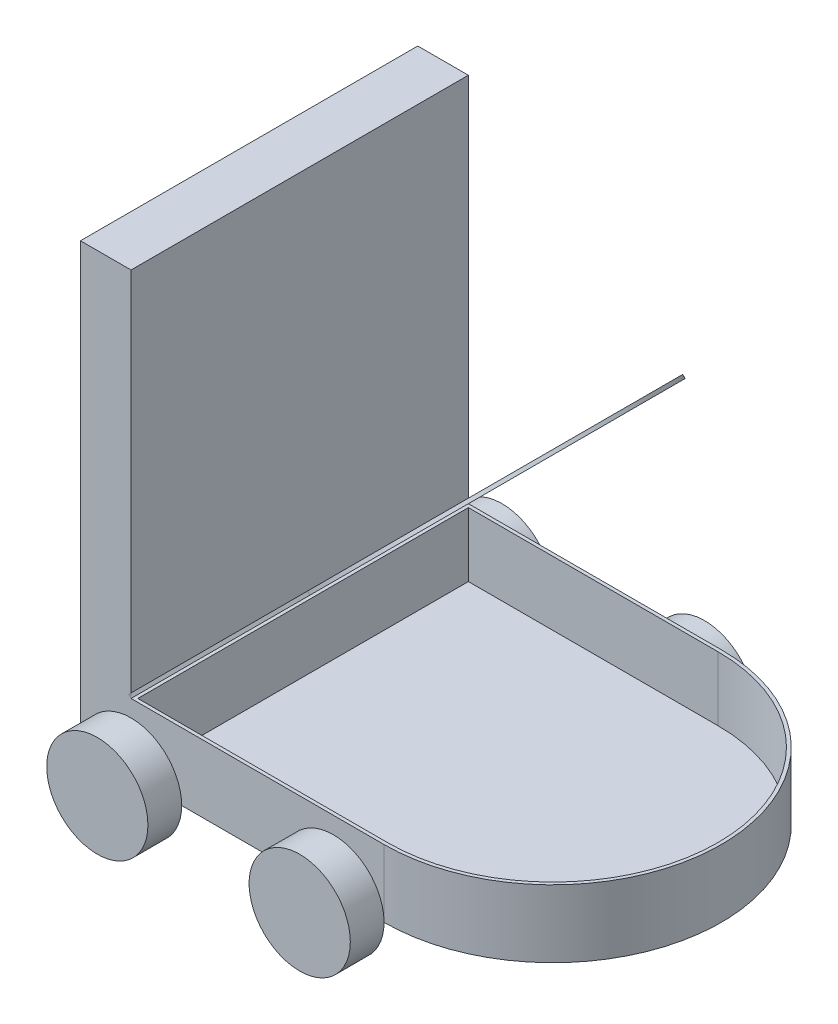
ISO-10303-21;
HEADER;
FILE_DESCRIPTION(('STEP AP214'),'2;1');
FILE_NAME('part.step','',(''),(''),'','','');
FILE_SCHEMA(('AUTOMOTIVE_DESIGN { 1 0 10303 214 1 1 1 1 }'));
ENDSEC;
DATA;
#1=APPLICATION_CONTEXT('core data for automotive mechanical design processes');
#2=APPLICATION_PROTOCOL_DEFINITION('international standard','automotive_design',2000,#1);
#3=PRODUCT_CONTEXT('',#1,'mechanical');
#4=PRODUCT('Part','Part','',(#3));
#5=PRODUCT_RELATED_PRODUCT_CATEGORY('part','',(#4));
#6=PRODUCT_DEFINITION_FORMATION('','',#4);
#7=PRODUCT_DEFINITION_CONTEXT('part definition',#1,'design');
#8=PRODUCT_DEFINITION('design','',#6,#7);
#9=PRODUCT_DEFINITION_SHAPE('','',#8);
#10=(LENGTH_UNIT() NAMED_UNIT(*) SI_UNIT(.MILLI.,.METRE.));
#11=(NAMED_UNIT(*) PLANE_ANGLE_UNIT() SI_UNIT($,.RADIAN.));
#12=(NAMED_UNIT(*) SI_UNIT($,.STERADIAN.) SOLID_ANGLE_UNIT());
#13=UNCERTAINTY_MEASURE_WITH_UNIT(LENGTH_MEASURE(1.E-05),#10,'distance_accuracy_value','');
#14=(GEOMETRIC_REPRESENTATION_CONTEXT(3) GLOBAL_UNCERTAINTY_ASSIGNED_CONTEXT((#13)) GLOBAL_UNIT_ASSIGNED_CONTEXT((#10,
#11,#12)) REPRESENTATION_CONTEXT('',''));
#15=CARTESIAN_POINT('',(0.,0.,0.));
#16=DIRECTION('',(0.,0.,1.));
#17=DIRECTION('',(1.,0.,0.));
#18=AXIS2_PLACEMENT_3D('',#15,#16,#17);
#19=CARTESIAN_POINT('',(67.3259018078044,88.7401153701777,-50.));
#20=DIRECTION('',(0.707106781186549,-0.707106781186546,0.));
#21=DIRECTION('',(0.707106781186546,0.707106781186549,0.));
#22=AXIS2_PLACEMENT_3D('',#19,#20,#21);
#23=PLANE('',#22);
#24=DIRECTION('',(-0.353553390593273,-0.353553390593274,-0.866025403784439));
#25=VECTOR('',#24,1.);
#26=CARTESIAN_POINT('',(49.6482322781408,71.062445840514,-9.99999999999999));
#27=LINE('',#26,#25);
#28=CARTESIAN_POINT('',(49.6482322781408,71.062445840514,-9.99999999999999));
#29=VERTEX_POINT('',#28);
#30=CARTESIAN_POINT('',(35.5060966544098,56.920310216783,-44.6410161513775));
#31=VERTEX_POINT('',#30);
#32=EDGE_CURVE('E201',#29,#31,#27,.T.);
#33=ORIENTED_EDGE('',*,*,#32,.F.);
#34=DIRECTION('',(0.707106781186546,0.707106781186549,0.));
#35=VECTOR('',#34,1.);
#36=CARTESIAN_POINT('',(21.3639610306789,42.778174593052,-9.99999999999999));
#37=LINE('',#36,#35);
#38=CARTESIAN_POINT('',(21.3639610306789,42.778174593052,-9.99999999999999));
#39=VERTEX_POINT('',#38);
#40=EDGE_CURVE('E207',#39,#29,#37,.T.);
#41=ORIENTED_EDGE('',*,*,#40,.F.);
#42=DIRECTION('',(-0.353553390593273,-0.353553390593274,0.866025403784439));
#43=VECTOR('',#42,1.);
#44=CARTESIAN_POINT('',(35.5060966544098,56.920310216783,-44.6410161513775));
#45=LINE('',#44,#43);
#46=EDGE_CURVE('E203',#31,#39,#45,.T.);
#47=ORIENTED_EDGE('',*,*,#46,.F.);
#48=EDGE_LOOP('',(#33,#41,#47));
#49=FACE_BOUND('',#48,.T.);
#50=CARTESIAN_POINT('',(67.3259018078044,88.7401153701777,-50.));
#51=DIRECTION('',(-0.707106781186549,0.707106781186546,0.));
#52=DIRECTION('',(0.707106781186546,0.707106781186549,0.));
#53=AXIS2_PLACEMENT_3D('',#50,#51,#52);
#54=CIRCLE('',#53,50.);
#55=CARTESIAN_POINT('',(67.3259018078044,88.7401153701777,0.));
#56=VERTEX_POINT('',#55);
#57=CARTESIAN_POINT('',(67.3259018078044,88.7401153701777,-100.));
#58=VERTEX_POINT('',#57);
#59=EDGE_CURVE('E256',#56,#58,#54,.T.);
#60=ORIENTED_EDGE('',*,*,#59,.T.);
#61=DIRECTION('',(-0.707106781186546,-0.707106781186549,0.));
#62=VECTOR('',#61,1.);
#63=CARTESIAN_POINT('',(67.3259018078044,88.7401153701777,-100.));
#64=LINE('',#63,#62);
#65=CARTESIAN_POINT('',(14.2928932188134,35.7071067811866,-100.));
#66=VERTEX_POINT('',#65);
#67=EDGE_CURVE('E259',#58,#66,#64,.T.);
#68=ORIENTED_EDGE('',*,*,#67,.T.);
#69=DIRECTION('',(0.,0.,1.));
#70=VECTOR('',#69,1.);
#71=CARTESIAN_POINT('',(14.2928932188134,35.7071067811866,-100.));
#72=LINE('',#71,#70);
#73=CARTESIAN_POINT('',(14.2928932188134,35.7071067811866,0.));
#74=VERTEX_POINT('',#73);
#75=EDGE_CURVE('E262',#66,#74,#72,.T.);
#76=ORIENTED_EDGE('',*,*,#75,.T.);
#77=DIRECTION('',(0.707106781186546,0.707106781186549,0.));
#78=VECTOR('',#77,1.);
#79=CARTESIAN_POINT('',(67.3259018078044,88.7401153701777,0.));
#80=LINE('',#79,#78);
#81=EDGE_CURVE('E264',#74,#56,#80,.T.);
#82=ORIENTED_EDGE('',*,*,#81,.T.);
#83=EDGE_LOOP('',(#60,#68,#76,#82));
#84=FACE_BOUND('',#83,.T.);
#85=DIRECTION('',(0.,0.,1.));
#86=VECTOR('',#85,1.);
#87=CARTESIAN_POINT('',(21.3639610306789,42.778174593052,-90.));
#88=LINE('',#87,#86);
#89=CARTESIAN_POINT('',(21.3639610306789,42.778174593052,-90.));
#90=VERTEX_POINT('',#89);
#91=CARTESIAN_POINT('',(21.3639610306789,42.778174593052,-50.));
#92=VERTEX_POINT('',#91);
#93=EDGE_CURVE('E225',#90,#92,#88,.T.);
#94=ORIENTED_EDGE('',*,*,#93,.F.);
#95=DIRECTION('',(-0.707106781186546,-0.707106781186549,0.));
#96=VECTOR('',#95,1.);
#97=CARTESIAN_POINT('',(21.3639610306789,42.778174593052,-90.));
#98=LINE('',#97,#96);
#99=CARTESIAN_POINT('',(49.6482322781408,71.062445840514,-90.));
#100=VERTEX_POINT('',#99);
#101=EDGE_CURVE('E233',#100,#90,#98,.T.);
#102=ORIENTED_EDGE('',*,*,#101,.F.);
#103=DIRECTION('',(0.,0.,-1.));
#104=VECTOR('',#103,1.);
#105=CARTESIAN_POINT('',(49.6482322781408,71.062445840514,-90.));
#106=LINE('',#105,#104);
#107=CARTESIAN_POINT('',(49.6482322781408,71.062445840514,-50.));
#108=VERTEX_POINT('',#107);
#109=EDGE_CURVE('E230',#108,#100,#106,.T.);
#110=ORIENTED_EDGE('',*,*,#109,.F.);
#111=DIRECTION('',(0.707106781186546,0.707106781186549,0.));
#112=VECTOR('',#111,1.);
#113=CARTESIAN_POINT('',(21.3639610306789,42.778174593052,-50.));
#114=LINE('',#113,#112);
#115=EDGE_CURVE('E227',#92,#108,#114,.T.);
#116=ORIENTED_EDGE('',*,*,#115,.F.);
#117=EDGE_LOOP('',(#94,#102,#110,#116));
#118=FACE_BOUND('',#117,.T.);
#119=DIRECTION('',(0.672498511963956,0.672498511963959,0.309016994374947));
#120=VECTOR('',#119,1.);
#121=CARTESIAN_POINT('',(56.7193000900062,78.1335136523795,-35.));
#122=LINE('',#121,#120);
#123=CARTESIAN_POINT('',(56.7193000900062,78.1335136523795,-35.));
#124=VERTEX_POINT('',#123);
#125=CARTESIAN_POINT('',(76.8942554489249,98.3084690112982,-25.7294901687516));
#126=VERTEX_POINT('',#125);
#127=EDGE_CURVE('E157',#124,#126,#122,.T.);
#128=ORIENTED_EDGE('',*,*,#127,.F.);
#129=DIRECTION('',(0.,0.,1.));
#130=VECTOR('',#129,1.);
#131=CARTESIAN_POINT('',(56.7193000900062,78.1335136523795,-65.0000000000001));
#132=LINE('',#131,#130);
#133=CARTESIAN_POINT('',(56.7193000900062,78.1335136523795,-65.0000000000001));
#134=VERTEX_POINT('',#133);
#135=EDGE_CURVE('E184',#134,#124,#132,.T.);
#136=ORIENTED_EDGE('',*,*,#135,.F.);
#137=DIRECTION('',(-0.672498511963956,-0.672498511963958,0.309016994374948));
#138=VECTOR('',#137,1.);
#139=CARTESIAN_POINT('',(76.8942554489249,98.3084690112982,-74.2705098312485));
#140=LINE('',#139,#138);
#141=CARTESIAN_POINT('',(76.8942554489249,98.3084690112982,-74.2705098312485));
#142=VERTEX_POINT('',#141);
#143=EDGE_CURVE('E180',#142,#134,#140,.T.);
#144=ORIENTED_EDGE('',*,*,#143,.F.);
#145=DIRECTION('',(-0.415626937777453,-0.415626937777454,-0.809016994374947));
#146=VECTOR('',#145,1.);
#147=CARTESIAN_POINT('',(89.3630635822485,110.777277144622,-50.0000000000001));
#148=LINE('',#147,#146);
#149=CARTESIAN_POINT('',(89.3630635822485,110.777277144622,-50.0000000000001));
#150=VERTEX_POINT('',#149);
#151=EDGE_CURVE('E178',#150,#142,#148,.T.);
#152=ORIENTED_EDGE('',*,*,#151,.F.);
#153=DIRECTION('',(0.415626937777453,0.415626937777454,-0.809016994374947));
#154=VECTOR('',#153,1.);
#155=CARTESIAN_POINT('',(76.8942554489249,98.3084690112982,-25.7294901687516));
#156=LINE('',#155,#154);
#157=EDGE_CURVE('E165',#126,#150,#156,.T.);
#158=ORIENTED_EDGE('',*,*,#157,.F.);
#159=EDGE_LOOP('',(#128,#136,#144,#152,#158));
#160=FACE_BOUND('',#159,.T.);
#161=ADVANCED_FACE('F44',(#49,#84,#118,#160),#23,.F.);
#162=CARTESIAN_POINT('',(68.033008588991,88.0330085889912,-50.));
#163=DIRECTION('',(0.707106781186549,-0.707106781186546,0.));
#164=DIRECTION('',(0.707106781186546,0.707106781186549,0.));
#165=AXIS2_PLACEMENT_3D('',#162,#163,#164);
#166=PLANE('',#165);
#167=DIRECTION('',(0.707106781186546,0.707106781186549,0.));
#168=VECTOR('',#167,1.);
#169=CARTESIAN_POINT('',(22.0710678118655,42.0710678118655,-9.99999999999999));
#170=LINE('',#169,#168);
#171=CARTESIAN_POINT('',(22.0710678118655,42.0710678118655,-9.99999999999999));
#172=VERTEX_POINT('',#171);
#173=CARTESIAN_POINT('',(50.3553390593273,70.3553390593274,-9.99999999999999));
#174=VERTEX_POINT('',#173);
#175=EDGE_CURVE('E204',#172,#174,#170,.T.);
#176=ORIENTED_EDGE('',*,*,#175,.T.);
#177=DIRECTION('',(-0.353553390593273,-0.353553390593274,-0.866025403784439));
#178=VECTOR('',#177,1.);
#179=CARTESIAN_POINT('',(50.3553390593273,70.3553390593274,-9.99999999999999));
#180=LINE('',#179,#178);
#181=CARTESIAN_POINT('',(36.2132034355964,56.2132034355965,-44.6410161513775));
#182=VERTEX_POINT('',#181);
#183=EDGE_CURVE('E173',#174,#182,#180,.T.);
#184=ORIENTED_EDGE('',*,*,#183,.T.);
#185=DIRECTION('',(-0.353553390593273,-0.353553390593274,0.866025403784439));
#186=VECTOR('',#185,1.);
#187=CARTESIAN_POINT('',(36.2132034355964,56.2132034355965,-44.6410161513775));
#188=LINE('',#187,#186);
#189=EDGE_CURVE('E212',#182,#172,#188,.T.);
#190=ORIENTED_EDGE('',*,*,#189,.T.);
#191=EDGE_LOOP('',(#176,#184,#190));
#192=FACE_BOUND('',#191,.T.);
#193=CARTESIAN_POINT('',(68.033008588991,88.0330085889912,-50.));
#194=DIRECTION('',(-0.707106781186549,0.707106781186546,0.));
#195=DIRECTION('',(0.707106781186546,0.707106781186549,0.));
#196=AXIS2_PLACEMENT_3D('',#193,#194,#195);
#197=CIRCLE('',#196,50.);
#198=CARTESIAN_POINT('',(68.033008588991,88.0330085889912,0.));
#199=VERTEX_POINT('',#198);
#200=CARTESIAN_POINT('',(68.033008588991,88.0330085889912,-100.));
#201=VERTEX_POINT('',#200);
#202=EDGE_CURVE('E255',#199,#201,#197,.T.);
#203=ORIENTED_EDGE('',*,*,#202,.F.);
#204=DIRECTION('',(0.707106781186546,0.707106781186549,0.));
#205=VECTOR('',#204,1.);
#206=CARTESIAN_POINT('',(68.033008588991,88.0330085889912,0.));
#207=LINE('',#206,#205);
#208=CARTESIAN_POINT('',(15.,35.,0.));
#209=VERTEX_POINT('',#208);
#210=EDGE_CURVE('E260',#209,#199,#207,.T.);
#211=ORIENTED_EDGE('',*,*,#210,.F.);
#212=DIRECTION('',(0.,0.,1.));
#213=VECTOR('',#212,1.);
#214=CARTESIAN_POINT('',(15.,35.,-100.));
#215=LINE('',#214,#213);
#216=CARTESIAN_POINT('',(15.,35.,-100.));
#217=VERTEX_POINT('',#216);
#218=EDGE_CURVE('E271',#217,#209,#215,.T.);
#219=ORIENTED_EDGE('',*,*,#218,.F.);
#220=DIRECTION('',(-0.707106781186546,-0.707106781186549,0.));
#221=VECTOR('',#220,1.);
#222=CARTESIAN_POINT('',(68.033008588991,88.0330085889912,-100.));
#223=LINE('',#222,#221);
#224=EDGE_CURVE('E269',#201,#217,#223,.T.);
#225=ORIENTED_EDGE('',*,*,#224,.F.);
#226=EDGE_LOOP('',(#203,#211,#219,#225));
#227=FACE_BOUND('',#226,.T.);
#228=DIRECTION('',(-0.707106781186546,-0.707106781186549,0.));
#229=VECTOR('',#228,1.);
#230=CARTESIAN_POINT('',(22.0710678118655,42.0710678118655,-90.));
#231=LINE('',#230,#229);
#232=CARTESIAN_POINT('',(50.3553390593273,70.3553390593274,-90.));
#233=VERTEX_POINT('',#232);
#234=CARTESIAN_POINT('',(22.0710678118655,42.0710678118655,-90.));
#235=VERTEX_POINT('',#234);
#236=EDGE_CURVE('E228',#233,#235,#231,.T.);
#237=ORIENTED_EDGE('',*,*,#236,.T.);
#238=DIRECTION('',(0.,0.,1.));
#239=VECTOR('',#238,1.);
#240=CARTESIAN_POINT('',(22.0710678118655,42.0710678118655,-90.));
#241=LINE('',#240,#239);
#242=CARTESIAN_POINT('',(22.0710678118655,42.0710678118655,-50.));
#243=VERTEX_POINT('',#242);
#244=EDGE_CURVE('E224',#235,#243,#241,.T.);
#245=ORIENTED_EDGE('',*,*,#244,.T.);
#246=DIRECTION('',(0.707106781186546,0.707106781186549,0.));
#247=VECTOR('',#246,1.);
#248=CARTESIAN_POINT('',(22.0710678118655,42.0710678118655,-50.));
#249=LINE('',#248,#247);
#250=CARTESIAN_POINT('',(50.3553390593273,70.3553390593274,-50.));
#251=VERTEX_POINT('',#250);
#252=EDGE_CURVE('E238',#243,#251,#249,.T.);
#253=ORIENTED_EDGE('',*,*,#252,.T.);
#254=DIRECTION('',(0.,0.,-1.));
#255=VECTOR('',#254,1.);
#256=CARTESIAN_POINT('',(50.3553390593273,70.3553390593274,-90.));
#257=LINE('',#256,#255);
#258=EDGE_CURVE('E241',#251,#233,#257,.T.);
#259=ORIENTED_EDGE('',*,*,#258,.T.);
#260=EDGE_LOOP('',(#237,#245,#253,#259));
#261=FACE_BOUND('',#260,.T.);
#262=DIRECTION('',(0.,0.,1.));
#263=VECTOR('',#262,1.);
#264=CARTESIAN_POINT('',(57.4264068711928,77.4264068711929,-65.0000000000001));
#265=LINE('',#264,#263);
#266=CARTESIAN_POINT('',(57.4264068711928,77.4264068711929,-65.0000000000001));
#267=VERTEX_POINT('',#266);
#268=CARTESIAN_POINT('',(57.4264068711928,77.4264068711929,-35.));
#269=VERTEX_POINT('',#268);
#270=EDGE_CURVE('E166',#267,#269,#265,.T.);
#271=ORIENTED_EDGE('',*,*,#270,.T.);
#272=DIRECTION('',(0.672498511963956,0.672498511963959,0.309016994374947));
#273=VECTOR('',#272,1.);
#274=CARTESIAN_POINT('',(57.4264068711928,77.4264068711929,-35.));
#275=LINE('',#274,#273);
#276=CARTESIAN_POINT('',(77.6013622301115,97.6013622301117,-25.7294901687516));
#277=VERTEX_POINT('',#276);
#278=EDGE_CURVE('E67',#269,#277,#275,.T.);
#279=ORIENTED_EDGE('',*,*,#278,.T.);
#280=DIRECTION('',(0.415626937777453,0.415626937777454,-0.809016994374947));
#281=VECTOR('',#280,1.);
#282=CARTESIAN_POINT('',(77.6013622301115,97.6013622301117,-25.7294901687516));
#283=LINE('',#282,#281);
#284=CARTESIAN_POINT('',(90.0701703634351,110.070170363435,-50.0000000000001));
#285=VERTEX_POINT('',#284);
#286=EDGE_CURVE('E172',#277,#285,#283,.T.);
#287=ORIENTED_EDGE('',*,*,#286,.T.);
#288=DIRECTION('',(-0.415626937777453,-0.415626937777454,-0.809016994374947));
#289=VECTOR('',#288,1.);
#290=CARTESIAN_POINT('',(90.0701703634351,110.070170363435,-50.0000000000001));
#291=LINE('',#290,#289);
#292=CARTESIAN_POINT('',(77.6013622301115,97.6013622301117,-74.2705098312485));
#293=VERTEX_POINT('',#292);
#294=EDGE_CURVE('E188',#285,#293,#291,.T.);
#295=ORIENTED_EDGE('',*,*,#294,.T.);
#296=DIRECTION('',(-0.672498511963956,-0.672498511963958,0.309016994374948));
#297=VECTOR('',#296,1.);
#298=CARTESIAN_POINT('',(77.6013622301115,97.6013622301117,-74.2705098312485));
#299=LINE('',#298,#297);
#300=EDGE_CURVE('E191',#293,#267,#299,.T.);
#301=ORIENTED_EDGE('',*,*,#300,.T.);
#302=EDGE_LOOP('',(#271,#279,#287,#295,#301));
#303=FACE_BOUND('',#302,.T.);
#304=ADVANCED_FACE('F289',(#192,#227,#261,#303),#166,.T.);
#305=CARTESIAN_POINT('',(67.3259018078044,88.7401153701777,-50.));
#306=DIRECTION('',(0.707106781186549,-0.707106781186546,0.));
#307=DIRECTION('',(0.707106781186546,0.707106781186549,0.));
#308=AXIS2_PLACEMENT_3D('',#305,#306,#307);
#309=CYLINDRICAL_SURFACE('',#308,50.);
#310=ORIENTED_EDGE('',*,*,#202,.T.);
#311=DIRECTION('',(0.707106781186549,-0.707106781186546,0.));
#312=VECTOR('',#311,1.);
#313=CARTESIAN_POINT('',(67.3259018078044,88.7401153701777,-100.));
#314=LINE('',#313,#312);
#315=EDGE_CURVE('E12',#58,#201,#314,.T.);
#316=ORIENTED_EDGE('',*,*,#315,.F.);
#317=ORIENTED_EDGE('',*,*,#59,.F.);
#318=DIRECTION('',(0.707106781186549,-0.707106781186546,0.));
#319=VECTOR('',#318,1.);
#320=CARTESIAN_POINT('',(67.3259018078044,88.7401153701777,0.));
#321=LINE('',#320,#319);
#322=EDGE_CURVE('E266',#56,#199,#321,.T.);
#323=ORIENTED_EDGE('',*,*,#322,.T.);
#324=EDGE_LOOP('',(#310,#316,#317,#323));
#325=FACE_BOUND('',#324,.T.);
#326=ADVANCED_FACE('F46',(#325),#309,.T.);
#327=CARTESIAN_POINT('',(67.3259018078044,88.7401153701777,-100.));
#328=DIRECTION('',(0.,0.,1.));
#329=DIRECTION('',(1.,0.,0.));
#330=AXIS2_PLACEMENT_3D('',#327,#328,#329);
#331=PLANE('',#330);
#332=ORIENTED_EDGE('',*,*,#224,.T.);
#333=DIRECTION('',(0.707106781186549,-0.707106781186546,0.));
#334=VECTOR('',#333,1.);
#335=CARTESIAN_POINT('',(14.2928932188134,35.7071067811866,-100.));
#336=LINE('',#335,#334);
#337=EDGE_CURVE('E52',#66,#217,#336,.T.);
#338=ORIENTED_EDGE('',*,*,#337,.F.);
#339=ORIENTED_EDGE('',*,*,#67,.F.);
#340=ORIENTED_EDGE('',*,*,#315,.T.);
#341=EDGE_LOOP('',(#332,#338,#339,#340));
#342=FACE_BOUND('',#341,.T.);
#343=ADVANCED_FACE('F300',(#342),#331,.F.);
#344=CARTESIAN_POINT('',(14.2928932188134,35.7071067811866,-100.));
#345=DIRECTION('',(0.707106781186546,0.707106781186549,0.));
#346=DIRECTION('',(-0.707106781186549,0.707106781186546,0.));
#347=AXIS2_PLACEMENT_3D('',#344,#345,#346);
#348=PLANE('',#347);
#349=ORIENTED_EDGE('',*,*,#218,.T.);
#350=DIRECTION('',(0.707106781186549,-0.707106781186546,0.));
#351=VECTOR('',#350,1.);
#352=CARTESIAN_POINT('',(14.2928932188134,35.7071067811866,0.));
#353=LINE('',#352,#351);
#354=EDGE_CURVE('E276',#74,#209,#353,.T.);
#355=ORIENTED_EDGE('',*,*,#354,.F.);
#356=ORIENTED_EDGE('',*,*,#75,.F.);
#357=ORIENTED_EDGE('',*,*,#337,.T.);
#358=EDGE_LOOP('',(#349,#355,#356,#357));
#359=FACE_BOUND('',#358,.T.);
#360=ADVANCED_FACE('F283',(#359),#348,.F.);
#361=CARTESIAN_POINT('',(67.3259018078044,88.7401153701777,0.));
#362=DIRECTION('',(0.,0.,-1.));
#363=DIRECTION('',(-1.,0.,0.));
#364=AXIS2_PLACEMENT_3D('',#361,#362,#363);
#365=PLANE('',#364);
#366=ORIENTED_EDGE('',*,*,#210,.T.);
#367=ORIENTED_EDGE('',*,*,#322,.F.);
#368=ORIENTED_EDGE('',*,*,#81,.F.);
#369=ORIENTED_EDGE('',*,*,#354,.T.);
#370=EDGE_LOOP('',(#366,#367,#368,#369));
#371=FACE_BOUND('',#370,.T.);
#372=ADVANCED_FACE('F293',(#371),#365,.F.);
#373=CARTESIAN_POINT('',(21.3639610306789,42.778174593052,-90.));
#374=DIRECTION('',(0.707106781186546,0.707106781186549,0.));
#375=DIRECTION('',(-0.707106781186549,0.707106781186546,0.));
#376=AXIS2_PLACEMENT_3D('',#373,#374,#375);
#377=PLANE('',#376);
#378=ORIENTED_EDGE('',*,*,#244,.F.);
#379=DIRECTION('',(0.707106781186549,-0.707106781186546,0.));
#380=VECTOR('',#379,1.);
#381=CARTESIAN_POINT('',(21.3639610306789,42.778174593052,-90.));
#382=LINE('',#381,#380);
#383=EDGE_CURVE('E235',#90,#235,#382,.T.);
#384=ORIENTED_EDGE('',*,*,#383,.F.);
#385=ORIENTED_EDGE('',*,*,#93,.T.);
#386=DIRECTION('',(0.707106781186549,-0.707106781186546,0.));
#387=VECTOR('',#386,1.);
#388=CARTESIAN_POINT('',(21.3639610306789,42.778174593052,-50.));
#389=LINE('',#388,#387);
#390=EDGE_CURVE('E252',#92,#243,#389,.T.);
#391=ORIENTED_EDGE('',*,*,#390,.T.);
#392=EDGE_LOOP('',(#378,#384,#385,#391));
#393=FACE_BOUND('',#392,.T.);
#394=ADVANCED_FACE('F317',(#393),#377,.T.);
#395=CARTESIAN_POINT('',(21.3639610306789,42.778174593052,-50.));
#396=DIRECTION('',(0.,0.,-1.));
#397=DIRECTION('',(-1.,0.,0.));
#398=AXIS2_PLACEMENT_3D('',#395,#396,#397);
#399=PLANE('',#398);
#400=ORIENTED_EDGE('',*,*,#252,.F.);
#401=ORIENTED_EDGE('',*,*,#390,.F.);
#402=ORIENTED_EDGE('',*,*,#115,.T.);
#403=DIRECTION('',(0.707106781186549,-0.707106781186546,0.));
#404=VECTOR('',#403,1.);
#405=CARTESIAN_POINT('',(49.6482322781408,71.062445840514,-50.));
#406=LINE('',#405,#404);
#407=EDGE_CURVE('E250',#108,#251,#406,.T.);
#408=ORIENTED_EDGE('',*,*,#407,.T.);
#409=EDGE_LOOP('',(#400,#401,#402,#408));
#410=FACE_BOUND('',#409,.T.);
#411=ADVANCED_FACE('F324',(#410),#399,.T.);
#412=CARTESIAN_POINT('',(49.6482322781408,71.062445840514,-90.));
#413=DIRECTION('',(-0.707106781186546,-0.707106781186549,0.));
#414=DIRECTION('',(0.707106781186549,-0.707106781186546,0.));
#415=AXIS2_PLACEMENT_3D('',#412,#413,#414);
#416=PLANE('',#415);
#417=ORIENTED_EDGE('',*,*,#258,.F.);
#418=ORIENTED_EDGE('',*,*,#407,.F.);
#419=ORIENTED_EDGE('',*,*,#109,.T.);
#420=DIRECTION('',(0.707106781186549,-0.707106781186546,0.));
#421=VECTOR('',#420,1.);
#422=CARTESIAN_POINT('',(49.6482322781408,71.062445840514,-90.));
#423=LINE('',#422,#421);
#424=EDGE_CURVE('E248',#100,#233,#423,.T.);
#425=ORIENTED_EDGE('',*,*,#424,.T.);
#426=EDGE_LOOP('',(#417,#418,#419,#425));
#427=FACE_BOUND('',#426,.T.);
#428=ADVANCED_FACE('F329',(#427),#416,.T.);
#429=CARTESIAN_POINT('',(21.3639610306789,42.778174593052,-90.));
#430=DIRECTION('',(0.,0.,1.));
#431=DIRECTION('',(0.,-1.,0.));
#432=AXIS2_PLACEMENT_3D('',#429,#430,#431);
#433=PLANE('',#432);
#434=ORIENTED_EDGE('',*,*,#236,.F.);
#435=ORIENTED_EDGE('',*,*,#424,.F.);
#436=ORIENTED_EDGE('',*,*,#101,.T.);
#437=ORIENTED_EDGE('',*,*,#383,.T.);
#438=EDGE_LOOP('',(#434,#435,#436,#437));
#439=FACE_BOUND('',#438,.T.);
#440=ADVANCED_FACE('F336',(#439),#433,.T.);
#441=CARTESIAN_POINT('',(49.6482322781408,71.062445840514,-9.99999999999999));
#442=DIRECTION('',(-0.612372435695793,-0.612372435695796,0.5));
#443=DIRECTION('',(0.707106781186549,-0.707106781186546,0.));
#444=AXIS2_PLACEMENT_3D('',#441,#442,#443);
#445=PLANE('',#444);
#446=ORIENTED_EDGE('',*,*,#183,.F.);
#447=DIRECTION('',(0.707106781186549,-0.707106781186546,0.));
#448=VECTOR('',#447,1.);
#449=CARTESIAN_POINT('',(49.6482322781408,71.062445840514,-9.99999999999999));
#450=LINE('',#449,#448);
#451=EDGE_CURVE('E209',#29,#174,#450,.T.);
#452=ORIENTED_EDGE('',*,*,#451,.F.);
#453=ORIENTED_EDGE('',*,*,#32,.T.);
#454=DIRECTION('',(0.707106781186549,-0.707106781186546,0.));
#455=VECTOR('',#454,1.);
#456=CARTESIAN_POINT('',(35.5060966544098,56.920310216783,-44.6410161513775));
#457=LINE('',#456,#455);
#458=EDGE_CURVE('E221',#31,#182,#457,.T.);
#459=ORIENTED_EDGE('',*,*,#458,.T.);
#460=EDGE_LOOP('',(#446,#452,#453,#459));
#461=FACE_BOUND('',#460,.T.);
#462=ADVANCED_FACE('F349',(#461),#445,.T.);
#463=CARTESIAN_POINT('',(35.5060966544098,56.920310216783,-44.6410161513775));
#464=DIRECTION('',(0.612372435695793,0.612372435695796,0.5));
#465=DIRECTION('',(-0.707106781186549,0.707106781186546,0.));
#466=AXIS2_PLACEMENT_3D('',#463,#464,#465);
#467=PLANE('',#466);
#468=ORIENTED_EDGE('',*,*,#189,.F.);
#469=ORIENTED_EDGE('',*,*,#458,.F.);
#470=ORIENTED_EDGE('',*,*,#46,.T.);
#471=DIRECTION('',(0.707106781186549,-0.707106781186546,0.));
#472=VECTOR('',#471,1.);
#473=CARTESIAN_POINT('',(21.3639610306789,42.778174593052,-9.99999999999999));
#474=LINE('',#473,#472);
#475=EDGE_CURVE('E219',#39,#172,#474,.T.);
#476=ORIENTED_EDGE('',*,*,#475,.T.);
#477=EDGE_LOOP('',(#468,#469,#470,#476));
#478=FACE_BOUND('',#477,.T.);
#479=ADVANCED_FACE('F354',(#478),#467,.T.);
#480=CARTESIAN_POINT('',(21.3639610306789,42.778174593052,-9.99999999999999));
#481=DIRECTION('',(0.,0.,-1.));
#482=DIRECTION('',(-1.,0.,0.));
#483=AXIS2_PLACEMENT_3D('',#480,#481,#482);
#484=PLANE('',#483);
#485=ORIENTED_EDGE('',*,*,#175,.F.);
#486=ORIENTED_EDGE('',*,*,#475,.F.);
#487=ORIENTED_EDGE('',*,*,#40,.T.);
#488=ORIENTED_EDGE('',*,*,#451,.T.);
#489=EDGE_LOOP('',(#485,#486,#487,#488));
#490=FACE_BOUND('',#489,.T.);
#491=ADVANCED_FACE('F358',(#490),#484,.T.);
#492=CARTESIAN_POINT('',(56.7193000900062,78.1335136523795,-35.));
#493=DIRECTION('',(0.21850801222441,0.218508012224411,-0.951056516295154));
#494=DIRECTION('',(0.,0.97460776237817,0.223918979794513));
#495=AXIS2_PLACEMENT_3D('',#492,#493,#494);
#496=PLANE('',#495);
#497=ORIENTED_EDGE('',*,*,#278,.F.);
#498=DIRECTION('',(0.707106781186549,-0.707106781186546,0.));
#499=VECTOR('',#498,1.);
#500=CARTESIAN_POINT('',(56.7193000900062,78.1335136523795,-35.));
#501=LINE('',#500,#499);
#502=EDGE_CURVE('E161',#124,#269,#501,.T.);
#503=ORIENTED_EDGE('',*,*,#502,.F.);
#504=ORIENTED_EDGE('',*,*,#127,.T.);
#505=DIRECTION('',(0.707106781186549,-0.707106781186546,0.));
#506=VECTOR('',#505,1.);
#507=CARTESIAN_POINT('',(76.8942554489249,98.3084690112982,-25.7294901687516));
#508=LINE('',#507,#506);
#509=EDGE_CURVE('E160',#126,#277,#508,.T.);
#510=ORIENTED_EDGE('',*,*,#509,.T.);
#511=EDGE_LOOP('',(#497,#503,#504,#510));
#512=FACE_BOUND('',#511,.T.);
#513=ADVANCED_FACE('F159',(#512),#496,.T.);
#514=CARTESIAN_POINT('',(76.8942554489249,98.3084690112982,-25.7294901687516));
#515=DIRECTION('',(-0.572061402817683,-0.572061402817685,-0.587785252292474));
#516=DIRECTION('',(0.,0.716627060372797,-0.697456562333055));
#517=AXIS2_PLACEMENT_3D('',#514,#515,#516);
#518=PLANE('',#517);
#519=ORIENTED_EDGE('',*,*,#286,.F.);
#520=ORIENTED_EDGE('',*,*,#509,.F.);
#521=ORIENTED_EDGE('',*,*,#157,.T.);
#522=DIRECTION('',(0.707106781186549,-0.707106781186546,0.));
#523=VECTOR('',#522,1.);
#524=CARTESIAN_POINT('',(89.3630635822485,110.777277144622,-50.0000000000001));
#525=LINE('',#524,#523);
#526=EDGE_CURVE('E174',#150,#285,#525,.T.);
#527=ORIENTED_EDGE('',*,*,#526,.T.);
#528=EDGE_LOOP('',(#519,#520,#521,#527));
#529=FACE_BOUND('',#528,.T.);
#530=ADVANCED_FACE('F169',(#529),#518,.T.);
#531=CARTESIAN_POINT('',(89.3630635822485,110.777277144622,-50.0000000000001));
#532=DIRECTION('',(-0.572061402817683,-0.572061402817685,0.587785252292473));
#533=DIRECTION('',(0.,-0.716627060372797,-0.697456562333056));
#534=AXIS2_PLACEMENT_3D('',#531,#532,#533);
#535=PLANE('',#534);
#536=ORIENTED_EDGE('',*,*,#294,.F.);
#537=ORIENTED_EDGE('',*,*,#526,.F.);
#538=ORIENTED_EDGE('',*,*,#151,.T.);
#539=DIRECTION('',(0.707106781186549,-0.707106781186546,0.));
#540=VECTOR('',#539,1.);
#541=CARTESIAN_POINT('',(76.8942554489249,98.3084690112982,-74.2705098312485));
#542=LINE('',#541,#540);
#543=EDGE_CURVE('E198',#142,#293,#542,.T.);
#544=ORIENTED_EDGE('',*,*,#543,.T.);
#545=EDGE_LOOP('',(#536,#537,#538,#544));
#546=FACE_BOUND('',#545,.T.);
#547=ADVANCED_FACE('F367',(#546),#535,.T.);
#548=CARTESIAN_POINT('',(76.8942554489249,98.3084690112982,-74.2705098312485));
#549=DIRECTION('',(0.218508012224411,0.218508012224411,0.951056516295153));
#550=DIRECTION('',(0.,-0.97460776237817,0.223918979794514));
#551=AXIS2_PLACEMENT_3D('',#548,#549,#550);
#552=PLANE('',#551);
#553=ORIENTED_EDGE('',*,*,#300,.F.);
#554=ORIENTED_EDGE('',*,*,#543,.F.);
#555=ORIENTED_EDGE('',*,*,#143,.T.);
#556=DIRECTION('',(0.707106781186549,-0.707106781186546,0.));
#557=VECTOR('',#556,1.);
#558=CARTESIAN_POINT('',(56.7193000900062,78.1335136523795,-65.0000000000001));
#559=LINE('',#558,#557);
#560=EDGE_CURVE('E59',#134,#267,#559,.T.);
#561=ORIENTED_EDGE('',*,*,#560,.T.);
#562=EDGE_LOOP('',(#553,#554,#555,#561));
#563=FACE_BOUND('',#562,.T.);
#564=ADVANCED_FACE('F370',(#563),#552,.T.);
#565=CARTESIAN_POINT('',(56.7193000900062,78.1335136523795,-65.0000000000001));
#566=DIRECTION('',(0.707106781186546,0.707106781186549,0.));
#567=DIRECTION('',(-0.707106781186549,0.707106781186546,0.));
#568=AXIS2_PLACEMENT_3D('',#565,#566,#567);
#569=PLANE('',#568);
#570=ORIENTED_EDGE('',*,*,#270,.F.);
#571=ORIENTED_EDGE('',*,*,#560,.F.);
#572=ORIENTED_EDGE('',*,*,#135,.T.);
#573=ORIENTED_EDGE('',*,*,#502,.T.);
#574=EDGE_LOOP('',(#570,#571,#572,#573));
#575=FACE_BOUND('',#574,.T.);
#576=ADVANCED_FACE('F374',(#575),#569,.T.);
#577=CLOSED_SHELL('',(#161,#304,#326,#343,#360,#372,#394,#411,#428,#440,#462,#479,#491,#513,
#530,#547,#564,#576));
#578=MANIFOLD_SOLID_BREP('B2',#577);
#579=CARTESIAN_POINT('',(15.,35.,-100.));
#580=DIRECTION('',(0.,0.,1.));
#581=DIRECTION('',(1.,0.,0.));
#582=AXIS2_PLACEMENT_3D('',#579,#580,#581);
#583=PLANE('',#582);
#584=CARTESIAN_POINT('',(75.,15.,-100.));
#585=DIRECTION('',(0.,0.,1.));
#586=DIRECTION('',(1.,0.,0.));
#587=AXIS2_PLACEMENT_3D('',#584,#585,#586);
#588=CIRCLE('',#587,15.);
#589=CARTESIAN_POINT('',(90.,15.,-100.));
#590=VERTEX_POINT('',#589);
#591=CARTESIAN_POINT('',(60.,15.,-100.));
#592=VERTEX_POINT('',#591);
#593=EDGE_CURVE('E586',#590,#592,#588,.T.);
#594=ORIENTED_EDGE('',*,*,#593,.T.);
#595=DIRECTION('',(-1.,0.,0.));
#596=VECTOR('',#595,1.);
#597=CARTESIAN_POINT('',(15.,15.,-100.));
#598=LINE('',#597,#596);
#599=CARTESIAN_POINT('',(30.,15.,-100.));
#600=VERTEX_POINT('',#599);
#601=EDGE_CURVE('E510',#592,#600,#598,.T.);
#602=ORIENTED_EDGE('',*,*,#601,.T.);
#603=CARTESIAN_POINT('',(15.,15.,-100.));
#604=DIRECTION('',(0.,0.,1.));
#605=DIRECTION('',(1.,0.,0.));
#606=AXIS2_PLACEMENT_3D('',#603,#604,#605);
#607=CIRCLE('',#606,15.);
#608=CARTESIAN_POINT('',(0.,15.,-100.));
#609=VERTEX_POINT('',#608);
#610=EDGE_CURVE('E610',#600,#609,#607,.T.);
#611=ORIENTED_EDGE('',*,*,#610,.T.);
#612=DIRECTION('',(0.,-1.,0.));
#613=VECTOR('',#612,1.);
#614=CARTESIAN_POINT('',(0.,145.,-100.));
#615=LINE('',#614,#613);
#616=CARTESIAN_POINT('',(0.,145.,-100.));
#617=VERTEX_POINT('',#616);
#618=EDGE_CURVE('E633',#617,#609,#615,.T.);
#619=ORIENTED_EDGE('',*,*,#618,.F.);
#620=DIRECTION('',(-1.,0.,0.));
#621=VECTOR('',#620,1.);
#622=CARTESIAN_POINT('',(0.,145.,-100.));
#623=LINE('',#622,#621);
#624=CARTESIAN_POINT('',(15.,145.,-100.));
#625=VERTEX_POINT('',#624);
#626=EDGE_CURVE('E631',#625,#617,#623,.T.);
#627=ORIENTED_EDGE('',*,*,#626,.F.);
#628=DIRECTION('',(0.,-1.,0.));
#629=VECTOR('',#628,1.);
#630=CARTESIAN_POINT('',(15.,145.,-100.));
#631=LINE('',#630,#629);
#632=CARTESIAN_POINT('',(15.,35.,-100.));
#633=VERTEX_POINT('',#632);
#634=EDGE_CURVE('E638',#625,#633,#631,.T.);
#635=ORIENTED_EDGE('',*,*,#634,.T.);
#636=DIRECTION('',(-1.,0.,0.));
#637=VECTOR('',#636,1.);
#638=CARTESIAN_POINT('',(15.,35.,-100.));
#639=LINE('',#638,#637);
#640=CARTESIAN_POINT('',(90.,35.,-100.));
#641=VERTEX_POINT('',#640);
#642=EDGE_CURVE('E681',#641,#633,#639,.T.);
#643=ORIENTED_EDGE('',*,*,#642,.F.);
#644=DIRECTION('',(0.,-1.,0.));
#645=VECTOR('',#644,1.);
#646=CARTESIAN_POINT('',(90.,35.,-100.));
#647=LINE('',#646,#645);
#648=EDGE_CURVE('E494',#641,#590,#647,.T.);
#649=ORIENTED_EDGE('',*,*,#648,.T.);
#650=EDGE_LOOP('',(#594,#602,#611,#619,#627,#635,#643,#649));
#651=FACE_BOUND('',#650,.T.);
#652=ADVANCED_FACE('F485',(#651),#583,.F.);
#653=CARTESIAN_POINT('',(15.,35.,0.));
#654=DIRECTION('',(0.,0.,-1.));
#655=DIRECTION('',(-1.,0.,0.));
#656=AXIS2_PLACEMENT_3D('',#653,#654,#655);
#657=PLANE('',#656);
#658=CARTESIAN_POINT('',(75.,15.,0.));
#659=DIRECTION('',(0.,0.,1.));
#660=DIRECTION('',(1.,0.,0.));
#661=AXIS2_PLACEMENT_3D('',#658,#659,#660);
#662=CIRCLE('',#661,15.);
#663=CARTESIAN_POINT('',(90.,15.,0.));
#664=VERTEX_POINT('',#663);
#665=CARTESIAN_POINT('',(60.,15.,0.));
#666=VERTEX_POINT('',#665);
#667=EDGE_CURVE('E607',#664,#666,#662,.T.);
#668=ORIENTED_EDGE('',*,*,#667,.F.);
#669=DIRECTION('',(0.,-1.,0.));
#670=VECTOR('',#669,1.);
#671=CARTESIAN_POINT('',(90.,35.,0.));
#672=LINE('',#671,#670);
#673=CARTESIAN_POINT('',(90.,35.,0.));
#674=VERTEX_POINT('',#673);
#675=EDGE_CURVE('E42',#674,#664,#672,.T.);
#676=ORIENTED_EDGE('',*,*,#675,.F.);
#677=DIRECTION('',(1.,0.,0.));
#678=VECTOR('',#677,1.);
#679=CARTESIAN_POINT('',(15.,35.,0.));
#680=LINE('',#679,#678);
#681=CARTESIAN_POINT('',(15.,35.,0.));
#682=VERTEX_POINT('',#681);
#683=EDGE_CURVE('E596',#682,#674,#680,.T.);
#684=ORIENTED_EDGE('',*,*,#683,.F.);
#685=DIRECTION('',(0.,-1.,0.));
#686=VECTOR('',#685,1.);
#687=CARTESIAN_POINT('',(15.,145.,0.));
#688=LINE('',#687,#686);
#689=CARTESIAN_POINT('',(15.,145.,0.));
#690=VERTEX_POINT('',#689);
#691=EDGE_CURVE('E646',#690,#682,#688,.T.);
#692=ORIENTED_EDGE('',*,*,#691,.F.);
#693=DIRECTION('',(1.,0.,0.));
#694=VECTOR('',#693,1.);
#695=CARTESIAN_POINT('',(0.,145.,0.));
#696=LINE('',#695,#694);
#697=CARTESIAN_POINT('',(0.,145.,0.));
#698=VERTEX_POINT('',#697);
#699=EDGE_CURVE('E627',#698,#690,#696,.T.);
#700=ORIENTED_EDGE('',*,*,#699,.F.);
#701=DIRECTION('',(0.,-1.,0.));
#702=VECTOR('',#701,1.);
#703=CARTESIAN_POINT('',(0.,145.,0.));
#704=LINE('',#703,#702);
#705=CARTESIAN_POINT('',(0.,15.,0.));
#706=VERTEX_POINT('',#705);
#707=EDGE_CURVE('E647',#698,#706,#704,.T.);
#708=ORIENTED_EDGE('',*,*,#707,.T.);
#709=CARTESIAN_POINT('',(15.,15.,0.));
#710=DIRECTION('',(0.,0.,1.));
#711=DIRECTION('',(1.,0.,0.));
#712=AXIS2_PLACEMENT_3D('',#709,#710,#711);
#713=CIRCLE('',#712,15.);
#714=CARTESIAN_POINT('',(30.,15.,0.));
#715=VERTEX_POINT('',#714);
#716=EDGE_CURVE('E621',#715,#706,#713,.T.);
#717=ORIENTED_EDGE('',*,*,#716,.F.);
#718=DIRECTION('',(1.,0.,0.));
#719=VECTOR('',#718,1.);
#720=CARTESIAN_POINT('',(15.,15.,0.));
#721=LINE('',#720,#719);
#722=EDGE_CURVE('E713',#715,#666,#721,.T.);
#723=ORIENTED_EDGE('',*,*,#722,.T.);
#724=EDGE_LOOP('',(#668,#676,#684,#692,#700,#708,#717,#723));
#725=FACE_BOUND('',#724,.T.);
#726=ADVANCED_FACE('F487',(#725),#657,.F.);
#727=CARTESIAN_POINT('',(90.,35.,-50.));
#728=DIRECTION('',(0.,-1.,0.));
#729=DIRECTION('',(0.,0.,-1.));
#730=AXIS2_PLACEMENT_3D('',#727,#728,#729);
#731=PLANE('',#730);
#732=ORIENTED_EDGE('',*,*,#683,.T.);
#733=CARTESIAN_POINT('',(90.,35.,-50.));
#734=DIRECTION('',(0.,1.,0.));
#735=DIRECTION('',(0.,0.,-1.));
#736=AXIS2_PLACEMENT_3D('',#733,#734,#735);
#737=CIRCLE('',#736,50.);
#738=EDGE_CURVE('E679',#674,#641,#737,.T.);
#739=ORIENTED_EDGE('',*,*,#738,.T.);
#740=ORIENTED_EDGE('',*,*,#642,.T.);
#741=DIRECTION('',(0.,0.,1.));
#742=VECTOR('',#741,1.);
#743=CARTESIAN_POINT('',(15.,35.,0.));
#744=LINE('',#743,#742);
#745=EDGE_CURVE('E687',#633,#682,#744,.T.);
#746=ORIENTED_EDGE('',*,*,#745,.T.);
#747=EDGE_LOOP('',(#732,#739,#740,#746));
#748=FACE_BOUND('',#747,.T.);
#749=DIRECTION('',(1.,0.,0.));
#750=VECTOR('',#749,1.);
#751=CARTESIAN_POINT('',(90.,35.,-1.));
#752=LINE('',#751,#750);
#753=CARTESIAN_POINT('',(16.,35.,-1.));
#754=VERTEX_POINT('',#753);
#755=CARTESIAN_POINT('',(90.,35.,-1.));
#756=VERTEX_POINT('',#755);
#757=EDGE_CURVE('E671',#754,#756,#752,.T.);
#758=ORIENTED_EDGE('',*,*,#757,.F.);
#759=DIRECTION('',(0.,0.,1.));
#760=VECTOR('',#759,1.);
#761=CARTESIAN_POINT('',(16.,35.,-50.));
#762=LINE('',#761,#760);
#763=CARTESIAN_POINT('',(16.,35.,-99.));
#764=VERTEX_POINT('',#763);
#765=EDGE_CURVE('E661',#764,#754,#762,.T.);
#766=ORIENTED_EDGE('',*,*,#765,.F.);
#767=DIRECTION('',(-1.,0.,0.));
#768=VECTOR('',#767,1.);
#769=CARTESIAN_POINT('',(90.,35.,-99.));
#770=LINE('',#769,#768);
#771=CARTESIAN_POINT('',(90.,35.,-99.));
#772=VERTEX_POINT('',#771);
#773=EDGE_CURVE('E675',#772,#764,#770,.T.);
#774=ORIENTED_EDGE('',*,*,#773,.F.);
#775=CARTESIAN_POINT('',(90.,35.,-50.));
#776=DIRECTION('',(0.,-1.,0.));
#777=DIRECTION('',(0.,0.,-1.));
#778=AXIS2_PLACEMENT_3D('',#775,#776,#777);
#779=CIRCLE('',#778,49.);
#780=EDGE_CURVE('E673',#756,#772,#779,.F.);
#781=ORIENTED_EDGE('',*,*,#780,.F.);
#782=EDGE_LOOP('',(#758,#766,#774,#781));
#783=FACE_BOUND('',#782,.T.);
#784=ADVANCED_FACE('F696',(#748,#783),#731,.F.);
#785=CARTESIAN_POINT('',(90.,35.,-50.));
#786=DIRECTION('',(0.,-1.,0.));
#787=DIRECTION('',(0.,0.,-1.));
#788=AXIS2_PLACEMENT_3D('',#785,#786,#787);
#789=CYLINDRICAL_SURFACE('',#788,50.);
#790=CARTESIAN_POINT('',(90.,15.,-50.));
#791=DIRECTION('',(0.,1.,0.));
#792=DIRECTION('',(0.,0.,-1.));
#793=AXIS2_PLACEMENT_3D('',#790,#791,#792);
#794=CIRCLE('',#793,50.);
#795=EDGE_CURVE('E582',#664,#590,#794,.T.);
#796=ORIENTED_EDGE('',*,*,#795,.T.);
#797=ORIENTED_EDGE('',*,*,#648,.F.);
#798=ORIENTED_EDGE('',*,*,#738,.F.);
#799=ORIENTED_EDGE('',*,*,#675,.T.);
#800=EDGE_LOOP('',(#796,#797,#798,#799));
#801=FACE_BOUND('',#800,.T.);
#802=ADVANCED_FACE('F711',(#801),#789,.T.);
#803=CARTESIAN_POINT('',(90.,15.,-50.));
#804=DIRECTION('',(0.,-1.,0.));
#805=DIRECTION('',(0.,0.,-1.));
#806=AXIS2_PLACEMENT_3D('',#803,#804,#805);
#807=PLANE('',#806);
#808=EDGE_CURVE('E684',#706,#715,#721,.T.);
#809=ORIENTED_EDGE('',*,*,#808,.F.);
#810=DIRECTION('',(0.,0.,1.));
#811=VECTOR('',#810,1.);
#812=CARTESIAN_POINT('',(0.,15.,-100.));
#813=LINE('',#812,#811);
#814=EDGE_CURVE('E620',#609,#706,#813,.T.);
#815=ORIENTED_EDGE('',*,*,#814,.F.);
#816=DIRECTION('',(-1.,0.,0.));
#817=VECTOR('',#816,1.);
#818=CARTESIAN_POINT('',(90.,15.,-100.));
#819=LINE('',#818,#817);
#820=EDGE_CURVE('E580',#600,#609,#819,.T.);
#821=ORIENTED_EDGE('',*,*,#820,.F.);
#822=ORIENTED_EDGE('',*,*,#601,.F.);
#823=EDGE_CURVE('E577',#590,#592,#598,.T.);
#824=ORIENTED_EDGE('',*,*,#823,.F.);
#825=ORIENTED_EDGE('',*,*,#795,.F.);
#826=EDGE_CURVE('E502',#666,#664,#721,.T.);
#827=ORIENTED_EDGE('',*,*,#826,.F.);
#828=ORIENTED_EDGE('',*,*,#722,.F.);
#829=EDGE_LOOP('',(#809,#815,#821,#822,#824,#825,#827,#828));
#830=FACE_BOUND('',#829,.T.);
#831=ADVANCED_FACE('F575',(#830),#807,.T.);
#832=CARTESIAN_POINT('',(15.,35.,-1.));
#833=DIRECTION('',(0.,0.,-1.));
#834=DIRECTION('',(-1.,0.,0.));
#835=AXIS2_PLACEMENT_3D('',#832,#833,#834);
#836=PLANE('',#835);
#837=DIRECTION('',(1.,0.,0.));
#838=VECTOR('',#837,1.);
#839=CARTESIAN_POINT('',(90.,16.,-1.));
#840=LINE('',#839,#838);
#841=CARTESIAN_POINT('',(16.,16.,-1.));
#842=VERTEX_POINT('',#841);
#843=CARTESIAN_POINT('',(90.,16.,-1.));
#844=VERTEX_POINT('',#843);
#845=EDGE_CURVE('E649',#842,#844,#840,.T.);
#846=ORIENTED_EDGE('',*,*,#845,.F.);
#847=DIRECTION('',(0.,-1.,0.));
#848=VECTOR('',#847,1.);
#849=CARTESIAN_POINT('',(16.,35.,-1.));
#850=LINE('',#849,#848);
#851=EDGE_CURVE('E657',#754,#842,#850,.T.);
#852=ORIENTED_EDGE('',*,*,#851,.F.);
#853=ORIENTED_EDGE('',*,*,#757,.T.);
#854=DIRECTION('',(0.,-1.,0.));
#855=VECTOR('',#854,1.);
#856=CARTESIAN_POINT('',(90.,35.,-1.));
#857=LINE('',#856,#855);
#858=EDGE_CURVE('E653',#756,#844,#857,.T.);
#859=ORIENTED_EDGE('',*,*,#858,.T.);
#860=EDGE_LOOP('',(#846,#852,#853,#859));
#861=FACE_BOUND('',#860,.T.);
#862=ADVANCED_FACE('F752',(#861),#836,.T.);
#863=CARTESIAN_POINT('',(90.,35.,-50.));
#864=DIRECTION('',(0.,-1.,0.));
#865=DIRECTION('',(0.,0.,-1.));
#866=AXIS2_PLACEMENT_3D('',#863,#864,#865);
#867=CYLINDRICAL_SURFACE('',#866,49.);
#868=CARTESIAN_POINT('',(90.,16.,-50.));
#869=DIRECTION('',(0.,-1.,0.));
#870=DIRECTION('',(0.,0.,-1.));
#871=AXIS2_PLACEMENT_3D('',#868,#869,#870);
#872=CIRCLE('',#871,49.);
#873=CARTESIAN_POINT('',(90.,16.,-99.));
#874=VERTEX_POINT('',#873);
#875=EDGE_CURVE('E652',#844,#874,#872,.F.);
#876=ORIENTED_EDGE('',*,*,#875,.F.);
#877=ORIENTED_EDGE('',*,*,#858,.F.);
#878=ORIENTED_EDGE('',*,*,#780,.T.);
#879=DIRECTION('',(0.,1.,0.));
#880=VECTOR('',#879,1.);
#881=CARTESIAN_POINT('',(90.,35.,-99.));
#882=LINE('',#881,#880);
#883=EDGE_CURVE('E656',#772,#874,#882,.F.);
#884=ORIENTED_EDGE('',*,*,#883,.T.);
#885=EDGE_LOOP('',(#876,#877,#878,#884));
#886=FACE_BOUND('',#885,.T.);
#887=ADVANCED_FACE('F768',(#886),#867,.F.);
#888=CARTESIAN_POINT('',(15.,35.,-99.));
#889=DIRECTION('',(0.,0.,1.));
#890=DIRECTION('',(1.,0.,0.));
#891=AXIS2_PLACEMENT_3D('',#888,#889,#890);
#892=PLANE('',#891);
#893=DIRECTION('',(-1.,0.,0.));
#894=VECTOR('',#893,1.);
#895=CARTESIAN_POINT('',(90.,16.,-99.));
#896=LINE('',#895,#894);
#897=CARTESIAN_POINT('',(16.,16.,-99.));
#898=VERTEX_POINT('',#897);
#899=EDGE_CURVE('E663',#874,#898,#896,.T.);
#900=ORIENTED_EDGE('',*,*,#899,.F.);
#901=ORIENTED_EDGE('',*,*,#883,.F.);
#902=ORIENTED_EDGE('',*,*,#773,.T.);
#903=DIRECTION('',(0.,-1.,0.));
#904=VECTOR('',#903,1.);
#905=CARTESIAN_POINT('',(16.,35.,-99.));
#906=LINE('',#905,#904);
#907=EDGE_CURVE('E660',#764,#898,#906,.T.);
#908=ORIENTED_EDGE('',*,*,#907,.T.);
#909=EDGE_LOOP('',(#900,#901,#902,#908));
#910=FACE_BOUND('',#909,.T.);
#911=ADVANCED_FACE('F764',(#910),#892,.T.);
#912=CARTESIAN_POINT('',(16.,35.,0.));
#913=DIRECTION('',(1.,0.,0.));
#914=DIRECTION('',(0.,0.,-1.));
#915=AXIS2_PLACEMENT_3D('',#912,#913,#914);
#916=PLANE('',#915);
#917=DIRECTION('',(0.,0.,1.));
#918=VECTOR('',#917,1.);
#919=CARTESIAN_POINT('',(16.,16.,-50.));
#920=LINE('',#919,#918);
#921=EDGE_CURVE('E667',#898,#842,#920,.T.);
#922=ORIENTED_EDGE('',*,*,#921,.F.);
#923=ORIENTED_EDGE('',*,*,#907,.F.);
#924=ORIENTED_EDGE('',*,*,#765,.T.);
#925=ORIENTED_EDGE('',*,*,#851,.T.);
#926=EDGE_LOOP('',(#922,#923,#924,#925));
#927=FACE_BOUND('',#926,.T.);
#928=ADVANCED_FACE('F760',(#927),#916,.T.);
#929=CARTESIAN_POINT('',(90.,16.,-50.));
#930=DIRECTION('',(0.,-1.,0.));
#931=DIRECTION('',(0.,0.,-1.));
#932=AXIS2_PLACEMENT_3D('',#929,#930,#931);
#933=PLANE('',#932);
#934=ORIENTED_EDGE('',*,*,#845,.T.);
#935=ORIENTED_EDGE('',*,*,#875,.T.);
#936=ORIENTED_EDGE('',*,*,#899,.T.);
#937=ORIENTED_EDGE('',*,*,#921,.T.);
#938=EDGE_LOOP('',(#934,#935,#936,#937));
#939=FACE_BOUND('',#938,.T.);
#940=ADVANCED_FACE('F756',(#939),#933,.F.);
#941=CARTESIAN_POINT('',(0.,145.,-100.));
#942=DIRECTION('',(1.,0.,0.));
#943=DIRECTION('',(0.,0.,-1.));
#944=AXIS2_PLACEMENT_3D('',#941,#942,#943);
#945=PLANE('',#944);
#946=ORIENTED_EDGE('',*,*,#814,.T.);
#947=ORIENTED_EDGE('',*,*,#707,.F.);
#948=DIRECTION('',(0.,0.,1.));
#949=VECTOR('',#948,1.);
#950=CARTESIAN_POINT('',(0.,145.,-100.));
#951=LINE('',#950,#949);
#952=EDGE_CURVE('E624',#617,#698,#951,.T.);
#953=ORIENTED_EDGE('',*,*,#952,.F.);
#954=ORIENTED_EDGE('',*,*,#618,.T.);
#955=EDGE_LOOP('',(#946,#947,#953,#954));
#956=FACE_BOUND('',#955,.T.);
#957=ADVANCED_FACE('F759',(#956),#945,.F.);
#958=CARTESIAN_POINT('',(15.,145.,-100.));
#959=DIRECTION('',(-1.,0.,0.));
#960=DIRECTION('',(0.,0.,1.));
#961=AXIS2_PLACEMENT_3D('',#958,#959,#960);
#962=PLANE('',#961);
#963=ORIENTED_EDGE('',*,*,#745,.F.);
#964=ORIENTED_EDGE('',*,*,#634,.F.);
#965=DIRECTION('',(0.,0.,-1.));
#966=VECTOR('',#965,1.);
#967=CARTESIAN_POINT('',(15.,145.,-100.));
#968=LINE('',#967,#966);
#969=EDGE_CURVE('E629',#690,#625,#968,.T.);
#970=ORIENTED_EDGE('',*,*,#969,.F.);
#971=ORIENTED_EDGE('',*,*,#691,.T.);
#972=EDGE_LOOP('',(#963,#964,#970,#971));
#973=FACE_BOUND('',#972,.T.);
#974=ADVANCED_FACE('F704',(#973),#962,.F.);
#975=CARTESIAN_POINT('',(0.,145.,0.));
#976=DIRECTION('',(0.,1.,0.));
#977=DIRECTION('',(0.,0.,1.));
#978=AXIS2_PLACEMENT_3D('',#975,#976,#977);
#979=PLANE('',#978);
#980=ORIENTED_EDGE('',*,*,#952,.T.);
#981=ORIENTED_EDGE('',*,*,#699,.T.);
#982=ORIENTED_EDGE('',*,*,#969,.T.);
#983=ORIENTED_EDGE('',*,*,#626,.T.);
#984=EDGE_LOOP('',(#980,#981,#982,#983));
#985=FACE_BOUND('',#984,.T.);
#986=ADVANCED_FACE('F781',(#985),#979,.T.);
#987=CARTESIAN_POINT('',(15.,15.,10.));
#988=DIRECTION('',(0.,0.,-1.));
#989=DIRECTION('',(-1.,0.,0.));
#990=AXIS2_PLACEMENT_3D('',#987,#988,#989);
#991=CYLINDRICAL_SURFACE('',#990,15.);
#992=CARTESIAN_POINT('',(15.,15.,10.));
#993=DIRECTION('',(0.,0.,1.));
#994=DIRECTION('',(1.,0.,0.));
#995=AXIS2_PLACEMENT_3D('',#992,#993,#994);
#996=CIRCLE('',#995,15.);
#997=CARTESIAN_POINT('',(30.,15.,10.));
#998=VERTEX_POINT('',#997);
#999=EDGE_CURVE('E617',#998,#998,#996,.T.);
#1000=ORIENTED_EDGE('',*,*,#999,.F.);
#1001=EDGE_LOOP('',(#1000));
#1002=FACE_BOUND('',#1001,.T.);
#1003=ORIENTED_EDGE('',*,*,#716,.T.);
#1004=EDGE_CURVE('E616',#706,#715,#713,.T.);
#1005=ORIENTED_EDGE('',*,*,#1004,.T.);
#1006=EDGE_LOOP('',(#1003,#1005));
#1007=FACE_BOUND('',#1006,.T.);
#1008=ADVANCED_FACE('F784',(#1002,#1007),#991,.T.);
#1009=CARTESIAN_POINT('',(15.,15.,10.));
#1010=DIRECTION('',(0.,0.,1.));
#1011=DIRECTION('',(1.,0.,0.));
#1012=AXIS2_PLACEMENT_3D('',#1009,#1010,#1011);
#1013=PLANE('',#1012);
#1014=ORIENTED_EDGE('',*,*,#999,.T.);
#1015=EDGE_LOOP('',(#1014));
#1016=FACE_BOUND('',#1015,.T.);
#1017=ADVANCED_FACE('F788',(#1016),#1013,.T.);
#1018=CARTESIAN_POINT('',(15.,15.,0.));
#1019=DIRECTION('',(0.,0.,1.));
#1020=DIRECTION('',(1.,0.,0.));
#1021=AXIS2_PLACEMENT_3D('',#1018,#1019,#1020);
#1022=PLANE('',#1021);
#1023=ORIENTED_EDGE('',*,*,#808,.T.);
#1024=ORIENTED_EDGE('',*,*,#1004,.F.);
#1025=EDGE_LOOP('',(#1023,#1024));
#1026=FACE_BOUND('',#1025,.T.);
#1027=ADVANCED_FACE('F790',(#1026),#1022,.F.);
#1028=CARTESIAN_POINT('',(15.,15.,-100.));
#1029=DIRECTION('',(0.,0.,-1.));
#1030=DIRECTION('',(-1.,0.,0.));
#1031=AXIS2_PLACEMENT_3D('',#1028,#1029,#1030);
#1032=CYLINDRICAL_SURFACE('',#1031,15.);
#1033=ORIENTED_EDGE('',*,*,#610,.F.);
#1034=EDGE_CURVE('E612',#609,#600,#607,.T.);
#1035=ORIENTED_EDGE('',*,*,#1034,.F.);
#1036=EDGE_LOOP('',(#1033,#1035));
#1037=FACE_BOUND('',#1036,.T.);
#1038=CARTESIAN_POINT('',(15.,15.,-110.));
#1039=DIRECTION('',(0.,0.,1.));
#1040=DIRECTION('',(1.,0.,0.));
#1041=AXIS2_PLACEMENT_3D('',#1038,#1039,#1040);
#1042=CIRCLE('',#1041,15.);
#1043=CARTESIAN_POINT('',(30.,15.,-110.));
#1044=VERTEX_POINT('',#1043);
#1045=EDGE_CURVE('E606',#1044,#1044,#1042,.T.);
#1046=ORIENTED_EDGE('',*,*,#1045,.T.);
#1047=EDGE_LOOP('',(#1046));
#1048=FACE_BOUND('',#1047,.T.);
#1049=ADVANCED_FACE('F793',(#1037,#1048),#1032,.T.);
#1050=CARTESIAN_POINT('',(15.,15.,-100.));
#1051=DIRECTION('',(0.,0.,1.));
#1052=DIRECTION('',(1.,0.,0.));
#1053=AXIS2_PLACEMENT_3D('',#1050,#1051,#1052);
#1054=PLANE('',#1053);
#1055=ORIENTED_EDGE('',*,*,#1034,.T.);
#1056=ORIENTED_EDGE('',*,*,#820,.T.);
#1057=EDGE_LOOP('',(#1055,#1056));
#1058=FACE_BOUND('',#1057,.T.);
#1059=ADVANCED_FACE('F734',(#1058),#1054,.T.);
#1060=CARTESIAN_POINT('',(15.,15.,-110.));
#1061=DIRECTION('',(0.,0.,1.));
#1062=DIRECTION('',(1.,0.,0.));
#1063=AXIS2_PLACEMENT_3D('',#1060,#1061,#1062);
#1064=PLANE('',#1063);
#1065=ORIENTED_EDGE('',*,*,#1045,.F.);
#1066=EDGE_LOOP('',(#1065));
#1067=FACE_BOUND('',#1066,.T.);
#1068=ADVANCED_FACE('F725',(#1067),#1064,.F.);
#1069=CARTESIAN_POINT('',(75.,15.,10.));
#1070=DIRECTION('',(0.,0.,-1.));
#1071=DIRECTION('',(-1.,0.,0.));
#1072=AXIS2_PLACEMENT_3D('',#1069,#1070,#1071);
#1073=CYLINDRICAL_SURFACE('',#1072,15.);
#1074=CARTESIAN_POINT('',(75.,15.,10.));
#1075=DIRECTION('',(0.,0.,1.));
#1076=DIRECTION('',(1.,0.,0.));
#1077=AXIS2_PLACEMENT_3D('',#1074,#1075,#1076);
#1078=CIRCLE('',#1077,15.);
#1079=CARTESIAN_POINT('',(90.,15.,10.));
#1080=VERTEX_POINT('',#1079);
#1081=EDGE_CURVE('E603',#1080,#1080,#1078,.T.);
#1082=ORIENTED_EDGE('',*,*,#1081,.F.);
#1083=EDGE_LOOP('',(#1082));
#1084=FACE_BOUND('',#1083,.T.);
#1085=ORIENTED_EDGE('',*,*,#667,.T.);
#1086=EDGE_CURVE('E591',#666,#664,#662,.T.);
#1087=ORIENTED_EDGE('',*,*,#1086,.T.);
#1088=EDGE_LOOP('',(#1085,#1087));
#1089=FACE_BOUND('',#1088,.T.);
#1090=ADVANCED_FACE('F722',(#1084,#1089),#1073,.T.);
#1091=CARTESIAN_POINT('',(75.,15.,10.));
#1092=DIRECTION('',(0.,0.,1.));
#1093=DIRECTION('',(1.,0.,0.));
#1094=AXIS2_PLACEMENT_3D('',#1091,#1092,#1093);
#1095=PLANE('',#1094);
#1096=ORIENTED_EDGE('',*,*,#1081,.T.);
#1097=EDGE_LOOP('',(#1096));
#1098=FACE_BOUND('',#1097,.T.);
#1099=ADVANCED_FACE('F724',(#1098),#1095,.T.);
#1100=CARTESIAN_POINT('',(75.,15.,0.));
#1101=DIRECTION('',(0.,0.,1.));
#1102=DIRECTION('',(1.,0.,0.));
#1103=AXIS2_PLACEMENT_3D('',#1100,#1101,#1102);
#1104=PLANE('',#1103);
#1105=ORIENTED_EDGE('',*,*,#826,.T.);
#1106=ORIENTED_EDGE('',*,*,#1086,.F.);
#1107=EDGE_LOOP('',(#1105,#1106));
#1108=FACE_BOUND('',#1107,.T.);
#1109=ADVANCED_FACE('F720',(#1108),#1104,.F.);
#1110=CARTESIAN_POINT('',(75.,15.,-100.));
#1111=DIRECTION('',(0.,0.,-1.));
#1112=DIRECTION('',(-1.,0.,0.));
#1113=AXIS2_PLACEMENT_3D('',#1110,#1111,#1112);
#1114=CYLINDRICAL_SURFACE('',#1113,15.);
#1115=ORIENTED_EDGE('',*,*,#593,.F.);
#1116=EDGE_CURVE('E592',#592,#590,#588,.T.);
#1117=ORIENTED_EDGE('',*,*,#1116,.F.);
#1118=EDGE_LOOP('',(#1115,#1117));
#1119=FACE_BOUND('',#1118,.T.);
#1120=CARTESIAN_POINT('',(75.,15.,-110.));
#1121=DIRECTION('',(0.,0.,1.));
#1122=DIRECTION('',(1.,0.,0.));
#1123=AXIS2_PLACEMENT_3D('',#1120,#1121,#1122);
#1124=CIRCLE('',#1123,15.);
#1125=CARTESIAN_POINT('',(90.,15.,-110.));
#1126=VERTEX_POINT('',#1125);
#1127=EDGE_CURVE('E599',#1126,#1126,#1124,.T.);
#1128=ORIENTED_EDGE('',*,*,#1127,.T.);
#1129=EDGE_LOOP('',(#1128));
#1130=FACE_BOUND('',#1129,.T.);
#1131=ADVANCED_FACE('F597',(#1119,#1130),#1114,.T.);
#1132=CARTESIAN_POINT('',(75.,15.,-100.));
#1133=DIRECTION('',(0.,0.,1.));
#1134=DIRECTION('',(1.,0.,0.));
#1135=AXIS2_PLACEMENT_3D('',#1132,#1133,#1134);
#1136=PLANE('',#1135);
#1137=ORIENTED_EDGE('',*,*,#1116,.T.);
#1138=ORIENTED_EDGE('',*,*,#823,.T.);
#1139=EDGE_LOOP('',(#1137,#1138));
#1140=FACE_BOUND('',#1139,.T.);
#1141=ADVANCED_FACE('F595',(#1140),#1136,.T.);
#1142=CARTESIAN_POINT('',(75.,15.,-110.));
#1143=DIRECTION('',(0.,0.,1.));
#1144=DIRECTION('',(1.,0.,0.));
#1145=AXIS2_PLACEMENT_3D('',#1142,#1143,#1144);
#1146=PLANE('',#1145);
#1147=ORIENTED_EDGE('',*,*,#1127,.F.);
#1148=EDGE_LOOP('',(#1147));
#1149=FACE_BOUND('',#1148,.T.);
#1150=ADVANCED_FACE('F832',(#1149),#1146,.F.);
#1151=CLOSED_SHELL('',(#652,#726,#784,#802,#831,#862,#887,#911,#928,#940,#957,#974,#986,#1008,
#1017,#1027,#1049,#1059,#1068,#1090,#1099,#1109,#1131,#1141,#1150));
#1152=MANIFOLD_SOLID_BREP('B6',#1151);
#1153=ADVANCED_BREP_SHAPE_REPRESENTATION('',(#18,#578,#1152),#14);
#1154=SHAPE_DEFINITION_REPRESENTATION(#9,#1153);
ENDSEC;
END-ISO-10303-21;
